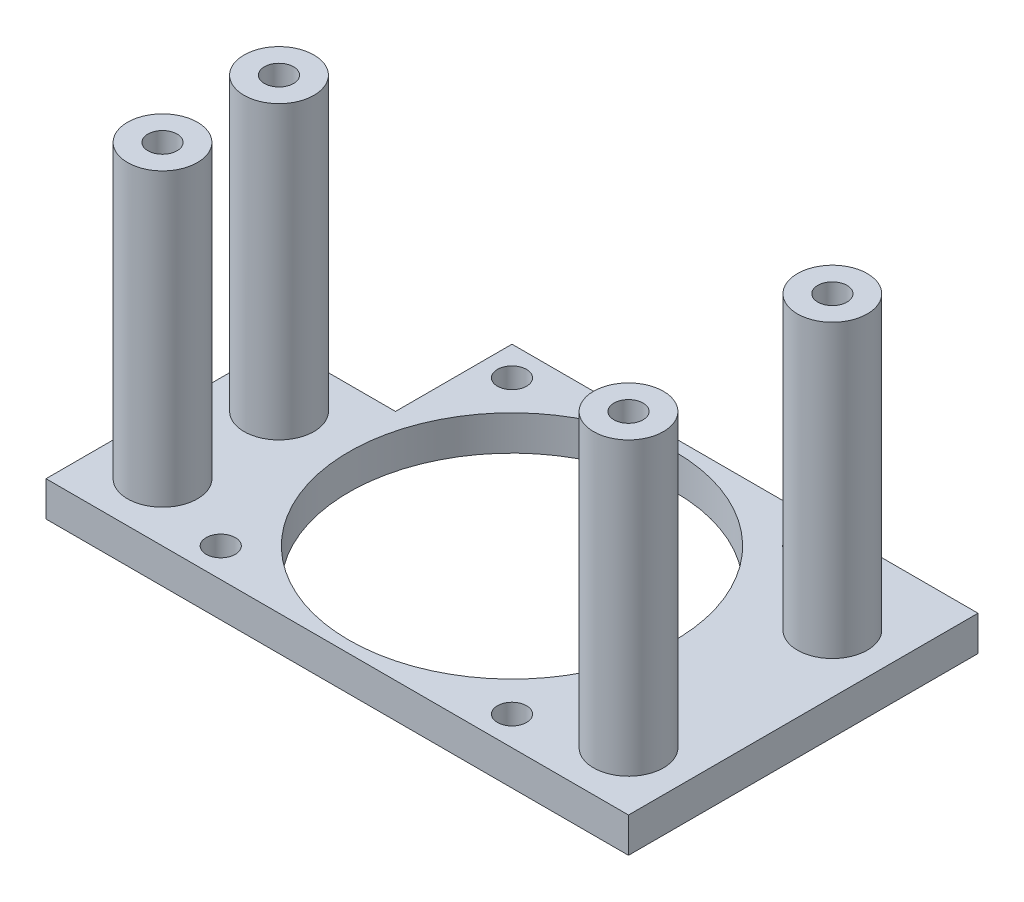
ISO-10303-21;
HEADER;
FILE_DESCRIPTION(('STEP AP214'),'2;1');
FILE_NAME('part.step','',(''),(''),'','','');
FILE_SCHEMA(('AUTOMOTIVE_DESIGN { 1 0 10303 214 1 1 1 1 }'));
ENDSEC;
DATA;
#1=APPLICATION_CONTEXT('core data for automotive mechanical design processes');
#2=APPLICATION_PROTOCOL_DEFINITION('international standard','automotive_design',2000,#1);
#3=PRODUCT_CONTEXT('',#1,'mechanical');
#4=PRODUCT('Part','Part','',(#3));
#5=PRODUCT_RELATED_PRODUCT_CATEGORY('part','',(#4));
#6=PRODUCT_DEFINITION_FORMATION('','',#4);
#7=PRODUCT_DEFINITION_CONTEXT('part definition',#1,'design');
#8=PRODUCT_DEFINITION('design','',#6,#7);
#9=PRODUCT_DEFINITION_SHAPE('','',#8);
#10=(LENGTH_UNIT() NAMED_UNIT(*) SI_UNIT(.MILLI.,.METRE.));
#11=(NAMED_UNIT(*) PLANE_ANGLE_UNIT() SI_UNIT($,.RADIAN.));
#12=(NAMED_UNIT(*) SI_UNIT($,.STERADIAN.) SOLID_ANGLE_UNIT());
#13=UNCERTAINTY_MEASURE_WITH_UNIT(LENGTH_MEASURE(1.E-05),#10,'distance_accuracy_value','');
#14=(GEOMETRIC_REPRESENTATION_CONTEXT(3) GLOBAL_UNCERTAINTY_ASSIGNED_CONTEXT((#13)) GLOBAL_UNIT_ASSIGNED_CONTEXT((#10,
#11,#12)) REPRESENTATION_CONTEXT('',''));
#15=CARTESIAN_POINT('',(0.,0.,0.));
#16=DIRECTION('',(0.,0.,1.));
#17=DIRECTION('',(1.,0.,0.));
#18=AXIS2_PLACEMENT_3D('',#15,#16,#17);
#19=CARTESIAN_POINT('',(40.,0.,20.));
#20=DIRECTION('',(0.,1.,0.));
#21=DIRECTION('',(0.,0.,1.));
#22=AXIS2_PLACEMENT_3D('',#19,#20,#21);
#23=CYLINDRICAL_SURFACE('',#22,2.5);
#24=CARTESIAN_POINT('',(40.,56.,20.));
#25=DIRECTION('',(0.,1.,0.));
#26=DIRECTION('',(0.,0.,1.));
#27=AXIS2_PLACEMENT_3D('',#24,#25,#26);
#28=CIRCLE('',#27,2.5);
#29=CARTESIAN_POINT('',(40.,56.,22.5));
#30=VERTEX_POINT('',#29);
#31=EDGE_CURVE('E180',#30,#30,#28,.T.);
#32=ORIENTED_EDGE('',*,*,#31,.T.);
#33=EDGE_LOOP('',(#32));
#34=FACE_BOUND('',#33,.T.);
#35=CARTESIAN_POINT('',(40.,50.,20.));
#36=DIRECTION('',(0.,-1.,0.));
#37=DIRECTION('',(0.,0.,-1.));
#38=AXIS2_PLACEMENT_3D('',#35,#36,#37);
#39=CIRCLE('',#38,2.5);
#40=CARTESIAN_POINT('',(40.,50.,17.5));
#41=VERTEX_POINT('',#40);
#42=EDGE_CURVE('E39',#41,#41,#39,.F.);
#43=ORIENTED_EDGE('',*,*,#42,.F.);
#44=EDGE_LOOP('',(#43));
#45=FACE_BOUND('',#44,.T.);
#46=ADVANCED_FACE('F35',(#34,#45),#23,.F.);
#47=CARTESIAN_POINT('',(40.,0.,-15.));
#48=DIRECTION('',(0.,1.,0.));
#49=DIRECTION('',(0.,0.,1.));
#50=AXIS2_PLACEMENT_3D('',#47,#48,#49);
#51=CYLINDRICAL_SURFACE('',#50,2.5);
#52=CARTESIAN_POINT('',(40.,56.,-15.));
#53=DIRECTION('',(0.,1.,0.));
#54=DIRECTION('',(0.,0.,1.));
#55=AXIS2_PLACEMENT_3D('',#52,#53,#54);
#56=CIRCLE('',#55,2.5);
#57=CARTESIAN_POINT('',(40.,56.,-12.5));
#58=VERTEX_POINT('',#57);
#59=EDGE_CURVE('E155',#58,#58,#56,.T.);
#60=ORIENTED_EDGE('',*,*,#59,.T.);
#61=EDGE_LOOP('',(#60));
#62=FACE_BOUND('',#61,.T.);
#63=CARTESIAN_POINT('',(40.,50.,-15.));
#64=DIRECTION('',(0.,-1.,0.));
#65=DIRECTION('',(0.,0.,-1.));
#66=AXIS2_PLACEMENT_3D('',#63,#64,#65);
#67=CIRCLE('',#66,2.5);
#68=CARTESIAN_POINT('',(40.,50.,-17.5));
#69=VERTEX_POINT('',#68);
#70=EDGE_CURVE('E159',#69,#69,#67,.F.);
#71=ORIENTED_EDGE('',*,*,#70,.F.);
#72=EDGE_LOOP('',(#71));
#73=FACE_BOUND('',#72,.T.);
#74=ADVANCED_FACE('F254',(#62,#73),#51,.F.);
#75=CARTESIAN_POINT('',(-40.,0.,20.));
#76=DIRECTION('',(0.,1.,0.));
#77=DIRECTION('',(0.,0.,1.));
#78=AXIS2_PLACEMENT_3D('',#75,#76,#77);
#79=CYLINDRICAL_SURFACE('',#78,2.5);
#80=CARTESIAN_POINT('',(-40.,56.,20.));
#81=DIRECTION('',(0.,1.,0.));
#82=DIRECTION('',(0.,0.,1.));
#83=AXIS2_PLACEMENT_3D('',#80,#81,#82);
#84=CIRCLE('',#83,2.5);
#85=CARTESIAN_POINT('',(-40.,56.,22.5));
#86=VERTEX_POINT('',#85);
#87=EDGE_CURVE('E176',#86,#86,#84,.T.);
#88=ORIENTED_EDGE('',*,*,#87,.T.);
#89=EDGE_LOOP('',(#88));
#90=FACE_BOUND('',#89,.T.);
#91=CARTESIAN_POINT('',(-40.,50.,20.));
#92=DIRECTION('',(0.,-1.,0.));
#93=DIRECTION('',(0.,0.,-1.));
#94=AXIS2_PLACEMENT_3D('',#91,#92,#93);
#95=CIRCLE('',#94,2.5);
#96=CARTESIAN_POINT('',(-40.,50.,17.5));
#97=VERTEX_POINT('',#96);
#98=EDGE_CURVE('E157',#97,#97,#95,.F.);
#99=ORIENTED_EDGE('',*,*,#98,.F.);
#100=EDGE_LOOP('',(#99));
#101=FACE_BOUND('',#100,.T.);
#102=ADVANCED_FACE('F260',(#90,#101),#79,.F.);
#103=CARTESIAN_POINT('',(-40.,0.,0.));
#104=DIRECTION('',(0.,1.,0.));
#105=DIRECTION('',(0.,0.,1.));
#106=AXIS2_PLACEMENT_3D('',#103,#104,#105);
#107=CYLINDRICAL_SURFACE('',#106,2.5);
#108=CARTESIAN_POINT('',(-40.,56.,0.));
#109=DIRECTION('',(0.,1.,0.));
#110=DIRECTION('',(0.,0.,1.));
#111=AXIS2_PLACEMENT_3D('',#108,#109,#110);
#112=CIRCLE('',#111,2.5);
#113=CARTESIAN_POINT('',(-40.,56.,2.5));
#114=VERTEX_POINT('',#113);
#115=EDGE_CURVE('E179',#114,#114,#112,.T.);
#116=ORIENTED_EDGE('',*,*,#115,.T.);
#117=EDGE_LOOP('',(#116));
#118=FACE_BOUND('',#117,.T.);
#119=CARTESIAN_POINT('',(-40.,50.,0.));
#120=DIRECTION('',(0.,-1.,0.));
#121=DIRECTION('',(0.,0.,-1.));
#122=AXIS2_PLACEMENT_3D('',#119,#120,#121);
#123=CIRCLE('',#122,2.5);
#124=CARTESIAN_POINT('',(-40.,50.,-2.5));
#125=VERTEX_POINT('',#124);
#126=EDGE_CURVE('E152',#125,#125,#123,.F.);
#127=ORIENTED_EDGE('',*,*,#126,.F.);
#128=EDGE_LOOP('',(#127));
#129=FACE_BOUND('',#128,.T.);
#130=ADVANCED_FACE('F267',(#118,#129),#107,.F.);
#131=CARTESIAN_POINT('',(0.,6.,0.));
#132=DIRECTION('',(0.,-1.,0.));
#133=DIRECTION('',(0.,0.,-1.));
#134=AXIS2_PLACEMENT_3D('',#131,#132,#133);
#135=PLANE('',#134);
#136=CARTESIAN_POINT('',(40.,6.,20.));
#137=DIRECTION('',(0.,-1.,0.));
#138=DIRECTION('',(0.,0.,-1.));
#139=AXIS2_PLACEMENT_3D('',#136,#137,#138);
#140=CIRCLE('',#139,6.00000000000001);
#141=CARTESIAN_POINT('',(40.,6.,14.));
#142=VERTEX_POINT('',#141);
#143=EDGE_CURVE('E11',#142,#142,#140,.F.);
#144=ORIENTED_EDGE('',*,*,#143,.F.);
#145=EDGE_LOOP('',(#144));
#146=FACE_BOUND('',#145,.T.);
#147=CARTESIAN_POINT('',(40.,6.,-15.));
#148=DIRECTION('',(0.,-1.,0.));
#149=DIRECTION('',(0.,0.,-1.));
#150=AXIS2_PLACEMENT_3D('',#147,#148,#149);
#151=CIRCLE('',#150,6.);
#152=CARTESIAN_POINT('',(40.,6.,-21.));
#153=VERTEX_POINT('',#152);
#154=EDGE_CURVE('E45',#153,#153,#151,.F.);
#155=ORIENTED_EDGE('',*,*,#154,.F.);
#156=EDGE_LOOP('',(#155));
#157=FACE_BOUND('',#156,.T.);
#158=CARTESIAN_POINT('',(-40.,6.,20.));
#159=DIRECTION('',(0.,-1.,0.));
#160=DIRECTION('',(0.,0.,-1.));
#161=AXIS2_PLACEMENT_3D('',#158,#159,#160);
#162=CIRCLE('',#161,6.);
#163=CARTESIAN_POINT('',(-40.,6.,14.));
#164=VERTEX_POINT('',#163);
#165=EDGE_CURVE('E147',#164,#164,#162,.F.);
#166=ORIENTED_EDGE('',*,*,#165,.F.);
#167=EDGE_LOOP('',(#166));
#168=FACE_BOUND('',#167,.T.);
#169=CARTESIAN_POINT('',(-40.,6.,0.));
#170=DIRECTION('',(0.,-1.,0.));
#171=DIRECTION('',(0.,0.,-1.));
#172=AXIS2_PLACEMENT_3D('',#169,#170,#171);
#173=CIRCLE('',#172,6.);
#174=CARTESIAN_POINT('',(-40.,6.,-6.));
#175=VERTEX_POINT('',#174);
#176=EDGE_CURVE('E144',#175,#175,#173,.F.);
#177=ORIENTED_EDGE('',*,*,#176,.F.);
#178=EDGE_LOOP('',(#177));
#179=FACE_BOUND('',#178,.T.);
#180=DIRECTION('',(-1.,0.,0.));
#181=VECTOR('',#180,1.);
#182=CARTESIAN_POINT('',(-30.,6.,-30.));
#183=LINE('',#182,#181);
#184=CARTESIAN_POINT('',(50.,6.,-30.));
#185=VERTEX_POINT('',#184);
#186=CARTESIAN_POINT('',(-30.,6.,-30.));
#187=VERTEX_POINT('',#186);
#188=EDGE_CURVE('E135',#185,#187,#183,.T.);
#189=ORIENTED_EDGE('',*,*,#188,.T.);
#190=DIRECTION('',(0.,0.,1.));
#191=VECTOR('',#190,1.);
#192=CARTESIAN_POINT('',(-30.,6.,-10.));
#193=LINE('',#192,#191);
#194=CARTESIAN_POINT('',(-30.,6.,-10.));
#195=VERTEX_POINT('',#194);
#196=EDGE_CURVE('E92',#187,#195,#193,.T.);
#197=ORIENTED_EDGE('',*,*,#196,.T.);
#198=DIRECTION('',(-1.,0.,0.));
#199=VECTOR('',#198,1.);
#200=CARTESIAN_POINT('',(-30.,6.,-10.));
#201=LINE('',#200,#199);
#202=CARTESIAN_POINT('',(-50.,6.,-10.));
#203=VERTEX_POINT('',#202);
#204=EDGE_CURVE('E106',#195,#203,#201,.T.);
#205=ORIENTED_EDGE('',*,*,#204,.T.);
#206=DIRECTION('',(0.,0.,1.));
#207=VECTOR('',#206,1.);
#208=CARTESIAN_POINT('',(-50.,6.,30.));
#209=LINE('',#208,#207);
#210=CARTESIAN_POINT('',(-50.,6.,30.));
#211=VERTEX_POINT('',#210);
#212=EDGE_CURVE('E99',#203,#211,#209,.T.);
#213=ORIENTED_EDGE('',*,*,#212,.T.);
#214=DIRECTION('',(1.,0.,0.));
#215=VECTOR('',#214,1.);
#216=CARTESIAN_POINT('',(-50.,6.,30.));
#217=LINE('',#216,#215);
#218=CARTESIAN_POINT('',(50.,6.,30.));
#219=VERTEX_POINT('',#218);
#220=EDGE_CURVE('E104',#211,#219,#217,.T.);
#221=ORIENTED_EDGE('',*,*,#220,.T.);
#222=DIRECTION('',(0.,0.,-1.));
#223=VECTOR('',#222,1.);
#224=CARTESIAN_POINT('',(50.,6.,-30.));
#225=LINE('',#224,#223);
#226=EDGE_CURVE('E54',#219,#185,#225,.T.);
#227=ORIENTED_EDGE('',*,*,#226,.T.);
#228=EDGE_LOOP('',(#189,#197,#205,#213,#221,#227));
#229=FACE_BOUND('',#228,.T.);
#230=CARTESIAN_POINT('',(0.,6.,0.));
#231=DIRECTION('',(0.,1.,0.));
#232=DIRECTION('',(0.,0.,1.));
#233=AXIS2_PLACEMENT_3D('',#230,#231,#232);
#234=CIRCLE('',#233,28.);
#235=CARTESIAN_POINT('',(0.,6.,28.));
#236=VERTEX_POINT('',#235);
#237=EDGE_CURVE('E128',#236,#236,#234,.T.);
#238=ORIENTED_EDGE('',*,*,#237,.F.);
#239=EDGE_LOOP('',(#238));
#240=FACE_BOUND('',#239,.T.);
#241=CARTESIAN_POINT('',(-25.,6.,-25.));
#242=DIRECTION('',(0.,1.,0.));
#243=DIRECTION('',(0.,0.,1.));
#244=AXIS2_PLACEMENT_3D('',#241,#242,#243);
#245=CIRCLE('',#244,2.5);
#246=CARTESIAN_POINT('',(-25.,6.,-22.5));
#247=VERTEX_POINT('',#246);
#248=EDGE_CURVE('E218',#247,#247,#245,.T.);
#249=ORIENTED_EDGE('',*,*,#248,.F.);
#250=EDGE_LOOP('',(#249));
#251=FACE_BOUND('',#250,.T.);
#252=CARTESIAN_POINT('',(25.,6.,-25.));
#253=DIRECTION('',(0.,1.,0.));
#254=DIRECTION('',(0.,0.,1.));
#255=AXIS2_PLACEMENT_3D('',#252,#253,#254);
#256=CIRCLE('',#255,2.49999999999999);
#257=CARTESIAN_POINT('',(25.,6.,-22.5));
#258=VERTEX_POINT('',#257);
#259=EDGE_CURVE('E212',#258,#258,#256,.T.);
#260=ORIENTED_EDGE('',*,*,#259,.F.);
#261=EDGE_LOOP('',(#260));
#262=FACE_BOUND('',#261,.T.);
#263=CARTESIAN_POINT('',(25.,6.,25.));
#264=DIRECTION('',(0.,1.,0.));
#265=DIRECTION('',(0.,0.,1.));
#266=AXIS2_PLACEMENT_3D('',#263,#264,#265);
#267=CIRCLE('',#266,2.49999999999999);
#268=CARTESIAN_POINT('',(25.,6.,27.5));
#269=VERTEX_POINT('',#268);
#270=EDGE_CURVE('E206',#269,#269,#267,.T.);
#271=ORIENTED_EDGE('',*,*,#270,.F.);
#272=EDGE_LOOP('',(#271));
#273=FACE_BOUND('',#272,.T.);
#274=CARTESIAN_POINT('',(-25.,6.,25.));
#275=DIRECTION('',(0.,1.,0.));
#276=DIRECTION('',(0.,0.,1.));
#277=AXIS2_PLACEMENT_3D('',#274,#275,#276);
#278=CIRCLE('',#277,2.5);
#279=CARTESIAN_POINT('',(-25.,6.,27.5));
#280=VERTEX_POINT('',#279);
#281=EDGE_CURVE('E200',#280,#280,#278,.T.);
#282=ORIENTED_EDGE('',*,*,#281,.F.);
#283=EDGE_LOOP('',(#282));
#284=FACE_BOUND('',#283,.T.);
#285=ADVANCED_FACE('F101',(#146,#157,#168,#179,#229,#240,#251,#262,#273,#284),#135,.F.);
#286=CARTESIAN_POINT('',(0.,0.,0.));
#287=DIRECTION('',(0.,-1.,0.));
#288=DIRECTION('',(0.,0.,-1.));
#289=AXIS2_PLACEMENT_3D('',#286,#287,#288);
#290=PLANE('',#289);
#291=CARTESIAN_POINT('',(-40.,0.,20.));
#292=DIRECTION('',(0.,-1.,0.));
#293=DIRECTION('',(0.,0.,-1.));
#294=AXIS2_PLACEMENT_3D('',#291,#292,#293);
#295=CIRCLE('',#294,4.25);
#296=CARTESIAN_POINT('',(-40.,0.,15.75));
#297=VERTEX_POINT('',#296);
#298=EDGE_CURVE('E329',#297,#297,#295,.T.);
#299=ORIENTED_EDGE('',*,*,#298,.F.);
#300=EDGE_LOOP('',(#299));
#301=FACE_BOUND('',#300,.T.);
#302=CARTESIAN_POINT('',(40.,0.,20.));
#303=DIRECTION('',(0.,-1.,0.));
#304=DIRECTION('',(0.,0.,-1.));
#305=AXIS2_PLACEMENT_3D('',#302,#303,#304);
#306=CIRCLE('',#305,4.25);
#307=CARTESIAN_POINT('',(40.,0.,15.75));
#308=VERTEX_POINT('',#307);
#309=EDGE_CURVE('E333',#308,#308,#306,.T.);
#310=ORIENTED_EDGE('',*,*,#309,.F.);
#311=EDGE_LOOP('',(#310));
#312=FACE_BOUND('',#311,.T.);
#313=CARTESIAN_POINT('',(40.,0.,-15.));
#314=DIRECTION('',(0.,-1.,0.));
#315=DIRECTION('',(0.,0.,-1.));
#316=AXIS2_PLACEMENT_3D('',#313,#314,#315);
#317=CIRCLE('',#316,4.25);
#318=CARTESIAN_POINT('',(40.,0.,-19.25));
#319=VERTEX_POINT('',#318);
#320=EDGE_CURVE('E337',#319,#319,#317,.T.);
#321=ORIENTED_EDGE('',*,*,#320,.F.);
#322=EDGE_LOOP('',(#321));
#323=FACE_BOUND('',#322,.T.);
#324=CARTESIAN_POINT('',(-40.,0.,0.));
#325=DIRECTION('',(0.,-1.,0.));
#326=DIRECTION('',(0.,0.,-1.));
#327=AXIS2_PLACEMENT_3D('',#324,#325,#326);
#328=CIRCLE('',#327,4.25000000000001);
#329=CARTESIAN_POINT('',(-40.,0.,-4.25000000000001));
#330=VERTEX_POINT('',#329);
#331=EDGE_CURVE('E165',#330,#330,#328,.T.);
#332=ORIENTED_EDGE('',*,*,#331,.F.);
#333=EDGE_LOOP('',(#332));
#334=FACE_BOUND('',#333,.T.);
#335=CARTESIAN_POINT('',(25.,0.,25.));
#336=DIRECTION('',(0.,1.,0.));
#337=DIRECTION('',(0.,0.,1.));
#338=AXIS2_PLACEMENT_3D('',#335,#336,#337);
#339=CIRCLE('',#338,2.49999999999999);
#340=CARTESIAN_POINT('',(25.,0.,27.5));
#341=VERTEX_POINT('',#340);
#342=EDGE_CURVE('E203',#341,#341,#339,.T.);
#343=ORIENTED_EDGE('',*,*,#342,.T.);
#344=EDGE_LOOP('',(#343));
#345=FACE_BOUND('',#344,.T.);
#346=CARTESIAN_POINT('',(-25.,0.,-25.));
#347=DIRECTION('',(0.,1.,0.));
#348=DIRECTION('',(0.,0.,1.));
#349=AXIS2_PLACEMENT_3D('',#346,#347,#348);
#350=CIRCLE('',#349,2.5);
#351=CARTESIAN_POINT('',(-25.,0.,-22.5));
#352=VERTEX_POINT('',#351);
#353=EDGE_CURVE('E215',#352,#352,#350,.T.);
#354=ORIENTED_EDGE('',*,*,#353,.T.);
#355=EDGE_LOOP('',(#354));
#356=FACE_BOUND('',#355,.T.);
#357=DIRECTION('',(-1.,0.,0.));
#358=VECTOR('',#357,1.);
#359=CARTESIAN_POINT('',(-30.,0.,-30.));
#360=LINE('',#359,#358);
#361=CARTESIAN_POINT('',(50.,0.,-30.));
#362=VERTEX_POINT('',#361);
#363=CARTESIAN_POINT('',(-30.,0.,-30.));
#364=VERTEX_POINT('',#363);
#365=EDGE_CURVE('E124',#362,#364,#360,.T.);
#366=ORIENTED_EDGE('',*,*,#365,.F.);
#367=DIRECTION('',(0.,0.,-1.));
#368=VECTOR('',#367,1.);
#369=CARTESIAN_POINT('',(50.,0.,-30.));
#370=LINE('',#369,#368);
#371=CARTESIAN_POINT('',(50.,0.,30.));
#372=VERTEX_POINT('',#371);
#373=EDGE_CURVE('E83',#372,#362,#370,.T.);
#374=ORIENTED_EDGE('',*,*,#373,.F.);
#375=DIRECTION('',(1.,0.,0.));
#376=VECTOR('',#375,1.);
#377=CARTESIAN_POINT('',(-50.,0.,30.));
#378=LINE('',#377,#376);
#379=CARTESIAN_POINT('',(-50.,0.,30.));
#380=VERTEX_POINT('',#379);
#381=EDGE_CURVE('E77',#380,#372,#378,.T.);
#382=ORIENTED_EDGE('',*,*,#381,.F.);
#383=DIRECTION('',(0.,0.,1.));
#384=VECTOR('',#383,1.);
#385=CARTESIAN_POINT('',(-50.,0.,30.));
#386=LINE('',#385,#384);
#387=CARTESIAN_POINT('',(-50.,0.,-10.));
#388=VERTEX_POINT('',#387);
#389=EDGE_CURVE('E114',#388,#380,#386,.T.);
#390=ORIENTED_EDGE('',*,*,#389,.F.);
#391=DIRECTION('',(-1.,0.,0.));
#392=VECTOR('',#391,1.);
#393=CARTESIAN_POINT('',(-30.,0.,-10.));
#394=LINE('',#393,#392);
#395=CARTESIAN_POINT('',(-30.,0.,-10.));
#396=VERTEX_POINT('',#395);
#397=EDGE_CURVE('E130',#396,#388,#394,.T.);
#398=ORIENTED_EDGE('',*,*,#397,.F.);
#399=DIRECTION('',(0.,0.,1.));
#400=VECTOR('',#399,1.);
#401=CARTESIAN_POINT('',(-30.,0.,-10.));
#402=LINE('',#401,#400);
#403=EDGE_CURVE('E127',#364,#396,#402,.T.);
#404=ORIENTED_EDGE('',*,*,#403,.F.);
#405=EDGE_LOOP('',(#366,#374,#382,#390,#398,#404));
#406=FACE_BOUND('',#405,.T.);
#407=CARTESIAN_POINT('',(0.,0.,0.));
#408=DIRECTION('',(0.,1.,0.));
#409=DIRECTION('',(0.,0.,1.));
#410=AXIS2_PLACEMENT_3D('',#407,#408,#409);
#411=CIRCLE('',#410,28.);
#412=CARTESIAN_POINT('',(0.,0.,28.));
#413=VERTEX_POINT('',#412);
#414=EDGE_CURVE('E221',#413,#413,#411,.T.);
#415=ORIENTED_EDGE('',*,*,#414,.T.);
#416=EDGE_LOOP('',(#415));
#417=FACE_BOUND('',#416,.T.);
#418=CARTESIAN_POINT('',(25.,0.,-25.));
#419=DIRECTION('',(0.,1.,0.));
#420=DIRECTION('',(0.,0.,1.));
#421=AXIS2_PLACEMENT_3D('',#418,#419,#420);
#422=CIRCLE('',#421,2.49999999999999);
#423=CARTESIAN_POINT('',(25.,0.,-22.5));
#424=VERTEX_POINT('',#423);
#425=EDGE_CURVE('E209',#424,#424,#422,.T.);
#426=ORIENTED_EDGE('',*,*,#425,.T.);
#427=EDGE_LOOP('',(#426));
#428=FACE_BOUND('',#427,.T.);
#429=CARTESIAN_POINT('',(-25.,0.,25.));
#430=DIRECTION('',(0.,1.,0.));
#431=DIRECTION('',(0.,0.,1.));
#432=AXIS2_PLACEMENT_3D('',#429,#430,#431);
#433=CIRCLE('',#432,2.5);
#434=CARTESIAN_POINT('',(-25.,0.,27.5));
#435=VERTEX_POINT('',#434);
#436=EDGE_CURVE('E199',#435,#435,#433,.T.);
#437=ORIENTED_EDGE('',*,*,#436,.T.);
#438=EDGE_LOOP('',(#437));
#439=FACE_BOUND('',#438,.T.);
#440=ADVANCED_FACE('F237',(#301,#312,#323,#334,#345,#356,#406,#417,#428,#439),#290,.T.);
#441=CARTESIAN_POINT('',(-30.,6.,-30.));
#442=DIRECTION('',(0.,0.,1.));
#443=DIRECTION('',(1.,0.,0.));
#444=AXIS2_PLACEMENT_3D('',#441,#442,#443);
#445=PLANE('',#444);
#446=ORIENTED_EDGE('',*,*,#365,.T.);
#447=DIRECTION('',(0.,-1.,0.));
#448=VECTOR('',#447,1.);
#449=CARTESIAN_POINT('',(-30.,6.,-30.));
#450=LINE('',#449,#448);
#451=EDGE_CURVE('E142',#187,#364,#450,.T.);
#452=ORIENTED_EDGE('',*,*,#451,.F.);
#453=ORIENTED_EDGE('',*,*,#188,.F.);
#454=DIRECTION('',(0.,-1.,0.));
#455=VECTOR('',#454,1.);
#456=CARTESIAN_POINT('',(50.,6.,-30.));
#457=LINE('',#456,#455);
#458=EDGE_CURVE('E120',#185,#362,#457,.T.);
#459=ORIENTED_EDGE('',*,*,#458,.T.);
#460=EDGE_LOOP('',(#446,#452,#453,#459));
#461=FACE_BOUND('',#460,.T.);
#462=ADVANCED_FACE('F37',(#461),#445,.F.);
#463=CARTESIAN_POINT('',(-30.,6.,-10.));
#464=DIRECTION('',(1.,0.,0.));
#465=DIRECTION('',(0.,0.,-1.));
#466=AXIS2_PLACEMENT_3D('',#463,#464,#465);
#467=PLANE('',#466);
#468=ORIENTED_EDGE('',*,*,#403,.T.);
#469=DIRECTION('',(0.,-1.,0.));
#470=VECTOR('',#469,1.);
#471=CARTESIAN_POINT('',(-30.,6.,-10.));
#472=LINE('',#471,#470);
#473=EDGE_CURVE('E139',#195,#396,#472,.T.);
#474=ORIENTED_EDGE('',*,*,#473,.F.);
#475=ORIENTED_EDGE('',*,*,#196,.F.);
#476=ORIENTED_EDGE('',*,*,#451,.T.);
#477=EDGE_LOOP('',(#468,#474,#475,#476));
#478=FACE_BOUND('',#477,.T.);
#479=ADVANCED_FACE('F231',(#478),#467,.F.);
#480=CARTESIAN_POINT('',(-30.,6.,-10.));
#481=DIRECTION('',(0.,0.,1.));
#482=DIRECTION('',(1.,0.,0.));
#483=AXIS2_PLACEMENT_3D('',#480,#481,#482);
#484=PLANE('',#483);
#485=ORIENTED_EDGE('',*,*,#397,.T.);
#486=DIRECTION('',(0.,-1.,0.));
#487=VECTOR('',#486,1.);
#488=CARTESIAN_POINT('',(-50.,6.,-10.));
#489=LINE('',#488,#487);
#490=EDGE_CURVE('E115',#203,#388,#489,.T.);
#491=ORIENTED_EDGE('',*,*,#490,.F.);
#492=ORIENTED_EDGE('',*,*,#204,.F.);
#493=ORIENTED_EDGE('',*,*,#473,.T.);
#494=EDGE_LOOP('',(#485,#491,#492,#493));
#495=FACE_BOUND('',#494,.T.);
#496=ADVANCED_FACE('F234',(#495),#484,.F.);
#497=CARTESIAN_POINT('',(-50.,6.,30.));
#498=DIRECTION('',(1.,0.,0.));
#499=DIRECTION('',(0.,0.,-1.));
#500=AXIS2_PLACEMENT_3D('',#497,#498,#499);
#501=PLANE('',#500);
#502=ORIENTED_EDGE('',*,*,#389,.T.);
#503=DIRECTION('',(0.,-1.,0.));
#504=VECTOR('',#503,1.);
#505=CARTESIAN_POINT('',(-50.,6.,30.));
#506=LINE('',#505,#504);
#507=EDGE_CURVE('E111',#211,#380,#506,.T.);
#508=ORIENTED_EDGE('',*,*,#507,.F.);
#509=ORIENTED_EDGE('',*,*,#212,.F.);
#510=ORIENTED_EDGE('',*,*,#490,.T.);
#511=EDGE_LOOP('',(#502,#508,#509,#510));
#512=FACE_BOUND('',#511,.T.);
#513=ADVANCED_FACE('F112',(#512),#501,.F.);
#514=CARTESIAN_POINT('',(-50.,6.,30.));
#515=DIRECTION('',(0.,0.,-1.));
#516=DIRECTION('',(-1.,0.,0.));
#517=AXIS2_PLACEMENT_3D('',#514,#515,#516);
#518=PLANE('',#517);
#519=ORIENTED_EDGE('',*,*,#381,.T.);
#520=DIRECTION('',(0.,-1.,0.));
#521=VECTOR('',#520,1.);
#522=CARTESIAN_POINT('',(50.,6.,30.));
#523=LINE('',#522,#521);
#524=EDGE_CURVE('E116',#219,#372,#523,.T.);
#525=ORIENTED_EDGE('',*,*,#524,.F.);
#526=ORIENTED_EDGE('',*,*,#220,.F.);
#527=ORIENTED_EDGE('',*,*,#507,.T.);
#528=EDGE_LOOP('',(#519,#525,#526,#527));
#529=FACE_BOUND('',#528,.T.);
#530=ADVANCED_FACE('F118',(#529),#518,.F.);
#531=CARTESIAN_POINT('',(50.,6.,-30.));
#532=DIRECTION('',(-1.,0.,0.));
#533=DIRECTION('',(0.,0.,1.));
#534=AXIS2_PLACEMENT_3D('',#531,#532,#533);
#535=PLANE('',#534);
#536=ORIENTED_EDGE('',*,*,#373,.T.);
#537=ORIENTED_EDGE('',*,*,#458,.F.);
#538=ORIENTED_EDGE('',*,*,#226,.F.);
#539=ORIENTED_EDGE('',*,*,#524,.T.);
#540=EDGE_LOOP('',(#536,#537,#538,#539));
#541=FACE_BOUND('',#540,.T.);
#542=ADVANCED_FACE('F240',(#541),#535,.F.);
#543=CARTESIAN_POINT('',(0.,6.,0.));
#544=DIRECTION('',(0.,-1.,0.));
#545=DIRECTION('',(0.,0.,-1.));
#546=AXIS2_PLACEMENT_3D('',#543,#544,#545);
#547=CYLINDRICAL_SURFACE('',#546,28.);
#548=ORIENTED_EDGE('',*,*,#237,.T.);
#549=EDGE_LOOP('',(#548));
#550=FACE_BOUND('',#549,.T.);
#551=ORIENTED_EDGE('',*,*,#414,.F.);
#552=EDGE_LOOP('',(#551));
#553=FACE_BOUND('',#552,.T.);
#554=ADVANCED_FACE('F242',(#550,#553),#547,.F.);
#555=CARTESIAN_POINT('',(-25.,6.,-25.));
#556=DIRECTION('',(0.,-1.,0.));
#557=DIRECTION('',(0.,0.,-1.));
#558=AXIS2_PLACEMENT_3D('',#555,#556,#557);
#559=CYLINDRICAL_SURFACE('',#558,2.5);
#560=ORIENTED_EDGE('',*,*,#248,.T.);
#561=EDGE_LOOP('',(#560));
#562=FACE_BOUND('',#561,.T.);
#563=ORIENTED_EDGE('',*,*,#353,.F.);
#564=EDGE_LOOP('',(#563));
#565=FACE_BOUND('',#564,.T.);
#566=ADVANCED_FACE('F248',(#562,#565),#559,.F.);
#567=CARTESIAN_POINT('',(25.,6.,-25.));
#568=DIRECTION('',(0.,-1.,0.));
#569=DIRECTION('',(0.,0.,-1.));
#570=AXIS2_PLACEMENT_3D('',#567,#568,#569);
#571=CYLINDRICAL_SURFACE('',#570,2.49999999999999);
#572=ORIENTED_EDGE('',*,*,#259,.T.);
#573=EDGE_LOOP('',(#572));
#574=FACE_BOUND('',#573,.T.);
#575=ORIENTED_EDGE('',*,*,#425,.F.);
#576=EDGE_LOOP('',(#575));
#577=FACE_BOUND('',#576,.T.);
#578=ADVANCED_FACE('F311',(#574,#577),#571,.F.);
#579=CARTESIAN_POINT('',(25.,6.,25.));
#580=DIRECTION('',(0.,-1.,0.));
#581=DIRECTION('',(0.,0.,-1.));
#582=AXIS2_PLACEMENT_3D('',#579,#580,#581);
#583=CYLINDRICAL_SURFACE('',#582,2.49999999999999);
#584=ORIENTED_EDGE('',*,*,#270,.T.);
#585=EDGE_LOOP('',(#584));
#586=FACE_BOUND('',#585,.T.);
#587=ORIENTED_EDGE('',*,*,#342,.F.);
#588=EDGE_LOOP('',(#587));
#589=FACE_BOUND('',#588,.T.);
#590=ADVANCED_FACE('F307',(#586,#589),#583,.F.);
#591=CARTESIAN_POINT('',(-25.,6.,25.));
#592=DIRECTION('',(0.,-1.,0.));
#593=DIRECTION('',(0.,0.,-1.));
#594=AXIS2_PLACEMENT_3D('',#591,#592,#593);
#595=CYLINDRICAL_SURFACE('',#594,2.5);
#596=ORIENTED_EDGE('',*,*,#281,.T.);
#597=EDGE_LOOP('',(#596));
#598=FACE_BOUND('',#597,.T.);
#599=ORIENTED_EDGE('',*,*,#436,.F.);
#600=EDGE_LOOP('',(#599));
#601=FACE_BOUND('',#600,.T.);
#602=ADVANCED_FACE('F303',(#598,#601),#595,.F.);
#603=CARTESIAN_POINT('',(-40.,56.,0.));
#604=DIRECTION('',(0.,-1.,0.));
#605=DIRECTION('',(0.,0.,-1.));
#606=AXIS2_PLACEMENT_3D('',#603,#604,#605);
#607=CYLINDRICAL_SURFACE('',#606,6.);
#608=CARTESIAN_POINT('',(-40.,56.,0.));
#609=DIRECTION('',(0.,1.,0.));
#610=DIRECTION('',(0.,0.,1.));
#611=AXIS2_PLACEMENT_3D('',#608,#609,#610);
#612=CIRCLE('',#611,6.);
#613=CARTESIAN_POINT('',(-40.,56.,6.));
#614=VERTEX_POINT('',#613);
#615=EDGE_CURVE('E196',#614,#614,#612,.T.);
#616=ORIENTED_EDGE('',*,*,#615,.F.);
#617=EDGE_LOOP('',(#616));
#618=FACE_BOUND('',#617,.T.);
#619=ORIENTED_EDGE('',*,*,#176,.T.);
#620=EDGE_LOOP('',(#619));
#621=FACE_BOUND('',#620,.T.);
#622=ADVANCED_FACE('F299',(#618,#621),#607,.T.);
#623=CARTESIAN_POINT('',(-40.,56.,0.));
#624=DIRECTION('',(0.,1.,0.));
#625=DIRECTION('',(0.,0.,1.));
#626=AXIS2_PLACEMENT_3D('',#623,#624,#625);
#627=PLANE('',#626);
#628=ORIENTED_EDGE('',*,*,#115,.F.);
#629=EDGE_LOOP('',(#628));
#630=FACE_BOUND('',#629,.T.);
#631=ORIENTED_EDGE('',*,*,#615,.T.);
#632=EDGE_LOOP('',(#631));
#633=FACE_BOUND('',#632,.T.);
#634=ADVANCED_FACE('F295',(#630,#633),#627,.T.);
#635=CARTESIAN_POINT('',(-40.,56.,20.));
#636=DIRECTION('',(0.,-1.,0.));
#637=DIRECTION('',(0.,0.,-1.));
#638=AXIS2_PLACEMENT_3D('',#635,#636,#637);
#639=CYLINDRICAL_SURFACE('',#638,6.);
#640=CARTESIAN_POINT('',(-40.,56.,20.));
#641=DIRECTION('',(0.,1.,0.));
#642=DIRECTION('',(0.,0.,1.));
#643=AXIS2_PLACEMENT_3D('',#640,#641,#642);
#644=CIRCLE('',#643,6.);
#645=CARTESIAN_POINT('',(-40.,56.,26.));
#646=VERTEX_POINT('',#645);
#647=EDGE_CURVE('E193',#646,#646,#644,.T.);
#648=ORIENTED_EDGE('',*,*,#647,.F.);
#649=EDGE_LOOP('',(#648));
#650=FACE_BOUND('',#649,.T.);
#651=ORIENTED_EDGE('',*,*,#165,.T.);
#652=EDGE_LOOP('',(#651));
#653=FACE_BOUND('',#652,.T.);
#654=ADVANCED_FACE('F291',(#650,#653),#639,.T.);
#655=CARTESIAN_POINT('',(-40.,56.,20.));
#656=DIRECTION('',(0.,1.,0.));
#657=DIRECTION('',(0.,0.,1.));
#658=AXIS2_PLACEMENT_3D('',#655,#656,#657);
#659=PLANE('',#658);
#660=ORIENTED_EDGE('',*,*,#87,.F.);
#661=EDGE_LOOP('',(#660));
#662=FACE_BOUND('',#661,.T.);
#663=ORIENTED_EDGE('',*,*,#647,.T.);
#664=EDGE_LOOP('',(#663));
#665=FACE_BOUND('',#664,.T.);
#666=ADVANCED_FACE('F287',(#662,#665),#659,.T.);
#667=CARTESIAN_POINT('',(40.,56.,-15.));
#668=DIRECTION('',(0.,-1.,0.));
#669=DIRECTION('',(0.,0.,-1.));
#670=AXIS2_PLACEMENT_3D('',#667,#668,#669);
#671=CYLINDRICAL_SURFACE('',#670,6.);
#672=CARTESIAN_POINT('',(40.,56.,-15.));
#673=DIRECTION('',(0.,1.,0.));
#674=DIRECTION('',(0.,0.,1.));
#675=AXIS2_PLACEMENT_3D('',#672,#673,#674);
#676=CIRCLE('',#675,6.);
#677=CARTESIAN_POINT('',(40.,56.,-9.));
#678=VERTEX_POINT('',#677);
#679=EDGE_CURVE('E190',#678,#678,#676,.T.);
#680=ORIENTED_EDGE('',*,*,#679,.F.);
#681=EDGE_LOOP('',(#680));
#682=FACE_BOUND('',#681,.T.);
#683=ORIENTED_EDGE('',*,*,#154,.T.);
#684=EDGE_LOOP('',(#683));
#685=FACE_BOUND('',#684,.T.);
#686=ADVANCED_FACE('F283',(#682,#685),#671,.T.);
#687=CARTESIAN_POINT('',(40.,56.,-15.));
#688=DIRECTION('',(0.,1.,0.));
#689=DIRECTION('',(0.,0.,1.));
#690=AXIS2_PLACEMENT_3D('',#687,#688,#689);
#691=PLANE('',#690);
#692=ORIENTED_EDGE('',*,*,#59,.F.);
#693=EDGE_LOOP('',(#692));
#694=FACE_BOUND('',#693,.T.);
#695=ORIENTED_EDGE('',*,*,#679,.T.);
#696=EDGE_LOOP('',(#695));
#697=FACE_BOUND('',#696,.T.);
#698=ADVANCED_FACE('F279',(#694,#697),#691,.T.);
#699=CARTESIAN_POINT('',(40.,56.,20.));
#700=DIRECTION('',(0.,-1.,0.));
#701=DIRECTION('',(0.,0.,-1.));
#702=AXIS2_PLACEMENT_3D('',#699,#700,#701);
#703=CYLINDRICAL_SURFACE('',#702,6.00000000000001);
#704=CARTESIAN_POINT('',(40.,56.,20.));
#705=DIRECTION('',(0.,1.,0.));
#706=DIRECTION('',(0.,0.,1.));
#707=AXIS2_PLACEMENT_3D('',#704,#705,#706);
#708=CIRCLE('',#707,6.00000000000001);
#709=CARTESIAN_POINT('',(40.,56.,26.));
#710=VERTEX_POINT('',#709);
#711=EDGE_CURVE('E187',#710,#710,#708,.T.);
#712=ORIENTED_EDGE('',*,*,#711,.F.);
#713=EDGE_LOOP('',(#712));
#714=FACE_BOUND('',#713,.T.);
#715=ORIENTED_EDGE('',*,*,#143,.T.);
#716=EDGE_LOOP('',(#715));
#717=FACE_BOUND('',#716,.T.);
#718=ADVANCED_FACE('F275',(#714,#717),#703,.T.);
#719=CARTESIAN_POINT('',(40.,56.,20.));
#720=DIRECTION('',(0.,1.,0.));
#721=DIRECTION('',(0.,0.,1.));
#722=AXIS2_PLACEMENT_3D('',#719,#720,#721);
#723=PLANE('',#722);
#724=ORIENTED_EDGE('',*,*,#31,.F.);
#725=EDGE_LOOP('',(#724));
#726=FACE_BOUND('',#725,.T.);
#727=ORIENTED_EDGE('',*,*,#711,.T.);
#728=EDGE_LOOP('',(#727));
#729=FACE_BOUND('',#728,.T.);
#730=ADVANCED_FACE('F271',(#726,#729),#723,.T.);
#731=CARTESIAN_POINT('',(-40.,50.,0.));
#732=DIRECTION('',(0.,-1.,0.));
#733=DIRECTION('',(0.,0.,-1.));
#734=AXIS2_PLACEMENT_3D('',#731,#732,#733);
#735=PLANE('',#734);
#736=CARTESIAN_POINT('',(-40.,50.,0.));
#737=DIRECTION('',(0.,-1.,0.));
#738=DIRECTION('',(0.,0.,-1.));
#739=AXIS2_PLACEMENT_3D('',#736,#737,#738);
#740=CIRCLE('',#739,4.25000000000001);
#741=CARTESIAN_POINT('',(-40.,50.,-4.25000000000001));
#742=VERTEX_POINT('',#741);
#743=EDGE_CURVE('E156',#742,#742,#740,.T.);
#744=ORIENTED_EDGE('',*,*,#743,.T.);
#745=EDGE_LOOP('',(#744));
#746=FACE_BOUND('',#745,.T.);
#747=ORIENTED_EDGE('',*,*,#126,.T.);
#748=EDGE_LOOP('',(#747));
#749=FACE_BOUND('',#748,.T.);
#750=ADVANCED_FACE('F274',(#746,#749),#735,.T.);
#751=CARTESIAN_POINT('',(-40.,50.,0.));
#752=DIRECTION('',(0.,-1.,0.));
#753=DIRECTION('',(0.,0.,-1.));
#754=AXIS2_PLACEMENT_3D('',#751,#752,#753);
#755=CYLINDRICAL_SURFACE('',#754,4.25000000000001);
#756=ORIENTED_EDGE('',*,*,#743,.F.);
#757=EDGE_LOOP('',(#756));
#758=FACE_BOUND('',#757,.T.);
#759=ORIENTED_EDGE('',*,*,#331,.T.);
#760=EDGE_LOOP('',(#759));
#761=FACE_BOUND('',#760,.T.);
#762=ADVANCED_FACE('F372',(#758,#761),#755,.F.);
#763=CARTESIAN_POINT('',(-40.,50.,20.));
#764=DIRECTION('',(0.,-1.,0.));
#765=DIRECTION('',(0.,0.,-1.));
#766=AXIS2_PLACEMENT_3D('',#763,#764,#765);
#767=PLANE('',#766);
#768=CARTESIAN_POINT('',(-40.,50.,20.));
#769=DIRECTION('',(0.,-1.,0.));
#770=DIRECTION('',(0.,0.,-1.));
#771=AXIS2_PLACEMENT_3D('',#768,#769,#770);
#772=CIRCLE('',#771,4.25);
#773=CARTESIAN_POINT('',(-40.,50.,15.75));
#774=VERTEX_POINT('',#773);
#775=EDGE_CURVE('E160',#774,#774,#772,.T.);
#776=ORIENTED_EDGE('',*,*,#775,.T.);
#777=EDGE_LOOP('',(#776));
#778=FACE_BOUND('',#777,.T.);
#779=ORIENTED_EDGE('',*,*,#98,.T.);
#780=EDGE_LOOP('',(#779));
#781=FACE_BOUND('',#780,.T.);
#782=ADVANCED_FACE('F357',(#778,#781),#767,.T.);
#783=CARTESIAN_POINT('',(-40.,50.,20.));
#784=DIRECTION('',(0.,-1.,0.));
#785=DIRECTION('',(0.,0.,-1.));
#786=AXIS2_PLACEMENT_3D('',#783,#784,#785);
#787=CYLINDRICAL_SURFACE('',#786,4.25);
#788=ORIENTED_EDGE('',*,*,#775,.F.);
#789=EDGE_LOOP('',(#788));
#790=FACE_BOUND('',#789,.T.);
#791=ORIENTED_EDGE('',*,*,#298,.T.);
#792=EDGE_LOOP('',(#791));
#793=FACE_BOUND('',#792,.T.);
#794=ADVANCED_FACE('F360',(#790,#793),#787,.F.);
#795=CARTESIAN_POINT('',(40.,50.,-15.));
#796=DIRECTION('',(0.,-1.,0.));
#797=DIRECTION('',(0.,0.,-1.));
#798=AXIS2_PLACEMENT_3D('',#795,#796,#797);
#799=PLANE('',#798);
#800=CARTESIAN_POINT('',(40.,50.,-15.));
#801=DIRECTION('',(0.,-1.,0.));
#802=DIRECTION('',(0.,0.,-1.));
#803=AXIS2_PLACEMENT_3D('',#800,#801,#802);
#804=CIRCLE('',#803,4.25);
#805=CARTESIAN_POINT('',(40.,50.,-19.25));
#806=VERTEX_POINT('',#805);
#807=EDGE_CURVE('E345',#806,#806,#804,.T.);
#808=ORIENTED_EDGE('',*,*,#807,.T.);
#809=EDGE_LOOP('',(#808));
#810=FACE_BOUND('',#809,.T.);
#811=ORIENTED_EDGE('',*,*,#70,.T.);
#812=EDGE_LOOP('',(#811));
#813=FACE_BOUND('',#812,.T.);
#814=ADVANCED_FACE('F363',(#810,#813),#799,.T.);
#815=CARTESIAN_POINT('',(40.,50.,-15.));
#816=DIRECTION('',(0.,-1.,0.));
#817=DIRECTION('',(0.,0.,-1.));
#818=AXIS2_PLACEMENT_3D('',#815,#816,#817);
#819=CYLINDRICAL_SURFACE('',#818,4.25);
#820=ORIENTED_EDGE('',*,*,#807,.F.);
#821=EDGE_LOOP('',(#820));
#822=FACE_BOUND('',#821,.T.);
#823=ORIENTED_EDGE('',*,*,#320,.T.);
#824=EDGE_LOOP('',(#823));
#825=FACE_BOUND('',#824,.T.);
#826=ADVANCED_FACE('F369',(#822,#825),#819,.F.);
#827=CARTESIAN_POINT('',(40.,50.,20.));
#828=DIRECTION('',(0.,-1.,0.));
#829=DIRECTION('',(0.,0.,-1.));
#830=AXIS2_PLACEMENT_3D('',#827,#828,#829);
#831=PLANE('',#830);
#832=CARTESIAN_POINT('',(40.,50.,20.));
#833=DIRECTION('',(0.,-1.,0.));
#834=DIRECTION('',(0.,0.,-1.));
#835=AXIS2_PLACEMENT_3D('',#832,#833,#834);
#836=CIRCLE('',#835,4.25);
#837=CARTESIAN_POINT('',(40.,50.,15.75));
#838=VERTEX_POINT('',#837);
#839=EDGE_CURVE('E350',#838,#838,#836,.T.);
#840=ORIENTED_EDGE('',*,*,#839,.T.);
#841=EDGE_LOOP('',(#840));
#842=FACE_BOUND('',#841,.T.);
#843=ORIENTED_EDGE('',*,*,#42,.T.);
#844=EDGE_LOOP('',(#843));
#845=FACE_BOUND('',#844,.T.);
#846=ADVANCED_FACE('F375',(#842,#845),#831,.T.);
#847=CARTESIAN_POINT('',(40.,50.,20.));
#848=DIRECTION('',(0.,-1.,0.));
#849=DIRECTION('',(0.,0.,-1.));
#850=AXIS2_PLACEMENT_3D('',#847,#848,#849);
#851=CYLINDRICAL_SURFACE('',#850,4.25);
#852=ORIENTED_EDGE('',*,*,#839,.F.);
#853=EDGE_LOOP('',(#852));
#854=FACE_BOUND('',#853,.T.);
#855=ORIENTED_EDGE('',*,*,#309,.T.);
#856=EDGE_LOOP('',(#855));
#857=FACE_BOUND('',#856,.T.);
#858=ADVANCED_FACE('F378',(#854,#857),#851,.F.);
#859=CLOSED_SHELL('',(#46,#74,#102,#130,#285,#440,#462,#479,#496,#513,#530,#542,#554,#566,#578,
#590,#602,#622,#634,#654,#666,#686,#698,#718,#730,#750,#762,#782,#794,#814,#826,#846,#858));
#860=MANIFOLD_SOLID_BREP('B2',#859);
#861=ADVANCED_BREP_SHAPE_REPRESENTATION('',(#18,#860),#14);
#862=SHAPE_DEFINITION_REPRESENTATION(#9,#861);
ENDSEC;
END-ISO-10303-21;
